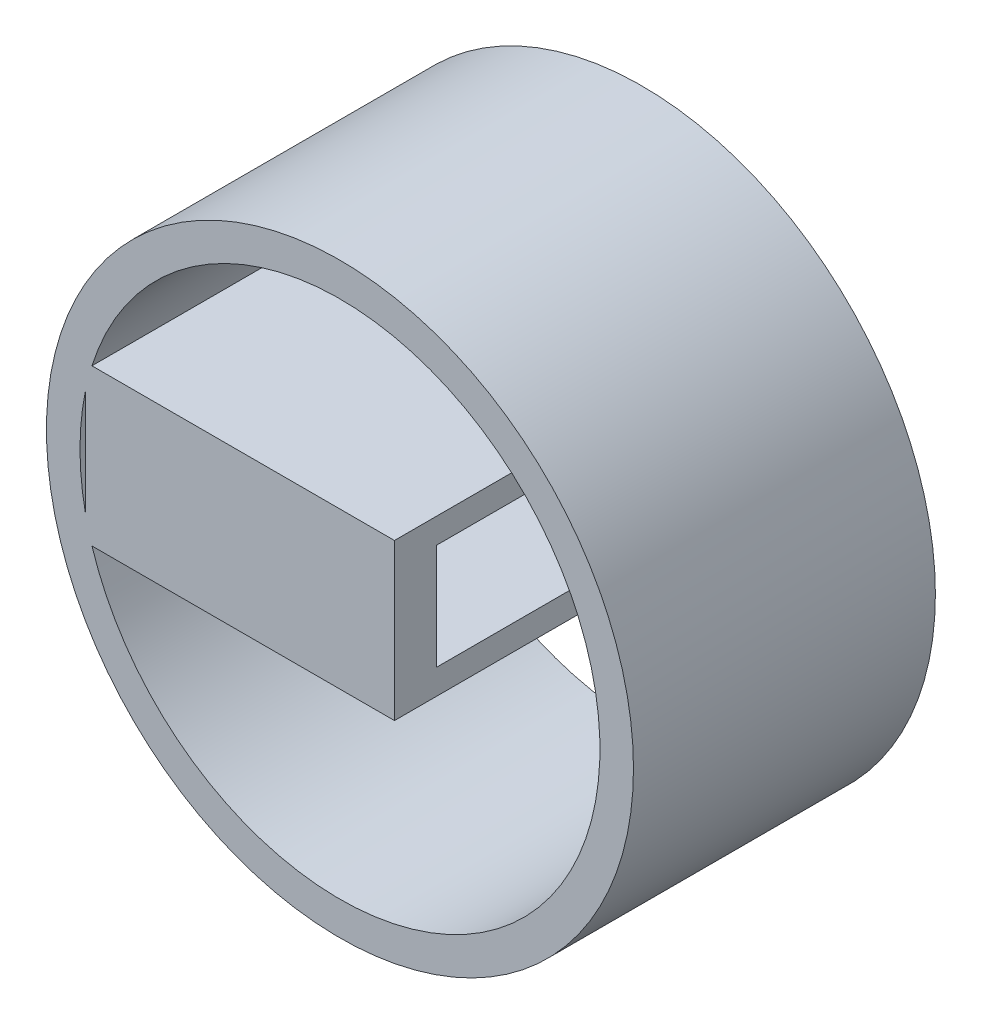
ISO-10303-21;
HEADER;
FILE_DESCRIPTION(('STEP AP214'),'2;1');
FILE_NAME('part.step','',(''),(''),'','','');
FILE_SCHEMA(('AUTOMOTIVE_DESIGN { 1 0 10303 214 1 1 1 1 }'));
ENDSEC;
DATA;
#1=APPLICATION_CONTEXT('core data for automotive mechanical design processes');
#2=APPLICATION_PROTOCOL_DEFINITION('international standard','automotive_design',2000,#1);
#3=PRODUCT_CONTEXT('',#1,'mechanical');
#4=PRODUCT('Part','Part','',(#3));
#5=PRODUCT_RELATED_PRODUCT_CATEGORY('part','',(#4));
#6=PRODUCT_DEFINITION_FORMATION('','',#4);
#7=PRODUCT_DEFINITION_CONTEXT('part definition',#1,'design');
#8=PRODUCT_DEFINITION('design','',#6,#7);
#9=PRODUCT_DEFINITION_SHAPE('','',#8);
#10=(LENGTH_UNIT() NAMED_UNIT(*) SI_UNIT(.MILLI.,.METRE.));
#11=(NAMED_UNIT(*) PLANE_ANGLE_UNIT() SI_UNIT($,.RADIAN.));
#12=(NAMED_UNIT(*) SI_UNIT($,.STERADIAN.) SOLID_ANGLE_UNIT());
#13=UNCERTAINTY_MEASURE_WITH_UNIT(LENGTH_MEASURE(1.E-05),#10,'distance_accuracy_value','');
#14=(GEOMETRIC_REPRESENTATION_CONTEXT(3) GLOBAL_UNCERTAINTY_ASSIGNED_CONTEXT((#13)) GLOBAL_UNIT_ASSIGNED_CONTEXT((#10,
#11,#12)) REPRESENTATION_CONTEXT('',''));
#15=CARTESIAN_POINT('',(0.,0.,0.));
#16=DIRECTION('',(0.,0.,1.));
#17=DIRECTION('',(1.,0.,0.));
#18=AXIS2_PLACEMENT_3D('',#15,#16,#17);
#19=CARTESIAN_POINT('',(0.,0.,36.));
#20=DIRECTION('',(0.,0.,-1.));
#21=DIRECTION('',(-1.,0.,0.));
#22=AXIS2_PLACEMENT_3D('',#19,#20,#21);
#23=CYLINDRICAL_SURFACE('',#22,31.);
#24=CARTESIAN_POINT('',(0.,0.,0.));
#25=DIRECTION('',(0.,0.,1.));
#26=DIRECTION('',(1.,0.,0.));
#27=AXIS2_PLACEMENT_3D('',#24,#25,#26);
#28=CIRCLE('',#27,31.);
#29=CARTESIAN_POINT('',(31.,0.,0.));
#30=VERTEX_POINT('',#29);
#31=EDGE_CURVE('E262',#30,#30,#28,.T.);
#32=ORIENTED_EDGE('',*,*,#31,.F.);
#33=EDGE_LOOP('',(#32));
#34=FACE_BOUND('',#33,.T.);
#35=CARTESIAN_POINT('',(0.,0.,0.999999999999994));
#36=DIRECTION('',(0.,0.,1.));
#37=DIRECTION('',(1.,0.,0.));
#38=AXIS2_PLACEMENT_3D('',#35,#36,#37);
#39=CIRCLE('',#38,31.);
#40=CARTESIAN_POINT('',(-30.3530888049305,6.3,0.999999999999994));
#41=VERTEX_POINT('',#40);
#42=CARTESIAN_POINT('',(-29.5721152439253,9.3,0.999999999999994));
#43=VERTEX_POINT('',#42);
#44=EDGE_CURVE('E165',#41,#43,#39,.F.);
#45=ORIENTED_EDGE('',*,*,#44,.F.);
#46=DIRECTION('',(0.,0.,1.));
#47=VECTOR('',#46,1.);
#48=CARTESIAN_POINT('',(-30.3530888049305,6.3,9.));
#49=LINE('',#48,#47);
#50=CARTESIAN_POINT('',(-30.3530888049305,6.3,16.));
#51=VERTEX_POINT('',#50);
#52=EDGE_CURVE('E259',#41,#51,#49,.T.);
#53=ORIENTED_EDGE('',*,*,#52,.T.);
#54=DIRECTION('',(0.,0.,1.));
#55=VECTOR('',#54,1.);
#56=CARTESIAN_POINT('',(-30.3530888049305,6.3,16.));
#57=LINE('',#56,#55);
#58=CARTESIAN_POINT('',(-30.3530888049305,6.3,36.));
#59=VERTEX_POINT('',#58);
#60=EDGE_CURVE('E227',#51,#59,#57,.T.);
#61=ORIENTED_EDGE('',*,*,#60,.T.);
#62=CARTESIAN_POINT('',(0.,0.,36.));
#63=DIRECTION('',(0.,0.,1.));
#64=DIRECTION('',(1.,0.,0.));
#65=AXIS2_PLACEMENT_3D('',#62,#63,#64);
#66=CIRCLE('',#65,31.);
#67=CARTESIAN_POINT('',(-30.3530888049305,-6.3,36.));
#68=VERTEX_POINT('',#67);
#69=EDGE_CURVE('E264',#59,#68,#66,.T.);
#70=ORIENTED_EDGE('',*,*,#69,.T.);
#71=DIRECTION('',(0.,0.,1.));
#72=VECTOR('',#71,1.);
#73=CARTESIAN_POINT('',(-30.3530888049305,-6.3,16.));
#74=LINE('',#73,#72);
#75=CARTESIAN_POINT('',(-30.3530888049305,-6.3,16.));
#76=VERTEX_POINT('',#75);
#77=EDGE_CURVE('E234',#76,#68,#74,.T.);
#78=ORIENTED_EDGE('',*,*,#77,.F.);
#79=DIRECTION('',(0.,0.,1.));
#80=VECTOR('',#79,1.);
#81=CARTESIAN_POINT('',(-30.3530888049305,-6.3,9.));
#82=LINE('',#81,#80);
#83=CARTESIAN_POINT('',(-30.3530888049305,-6.3,0.999999999999994));
#84=VERTEX_POINT('',#83);
#85=EDGE_CURVE('E245',#84,#76,#82,.T.);
#86=ORIENTED_EDGE('',*,*,#85,.F.);
#87=CARTESIAN_POINT('',(0.,0.,0.999999999999994));
#88=DIRECTION('',(0.,0.,1.));
#89=DIRECTION('',(1.,0.,0.));
#90=AXIS2_PLACEMENT_3D('',#87,#88,#89);
#91=CIRCLE('',#90,31.);
#92=CARTESIAN_POINT('',(-29.5721152439253,-9.3,0.999999999999994));
#93=VERTEX_POINT('',#92);
#94=EDGE_CURVE('E177',#93,#84,#91,.F.);
#95=ORIENTED_EDGE('',*,*,#94,.F.);
#96=DIRECTION('',(0.,0.,1.));
#97=VECTOR('',#96,1.);
#98=CARTESIAN_POINT('',(-29.5721152439253,-9.3,9.));
#99=LINE('',#98,#97);
#100=CARTESIAN_POINT('',(-29.5721152439253,-9.3,36.));
#101=VERTEX_POINT('',#100);
#102=EDGE_CURVE('E247',#93,#101,#99,.T.);
#103=ORIENTED_EDGE('',*,*,#102,.T.);
#104=CARTESIAN_POINT('',(-29.5721152439253,9.3,36.));
#105=VERTEX_POINT('',#104);
#106=EDGE_CURVE('E268',#101,#105,#66,.T.);
#107=ORIENTED_EDGE('',*,*,#106,.T.);
#108=DIRECTION('',(0.,0.,1.));
#109=VECTOR('',#108,1.);
#110=CARTESIAN_POINT('',(-29.5721152439253,9.3,9.));
#111=LINE('',#110,#109);
#112=EDGE_CURVE('E257',#43,#105,#111,.T.);
#113=ORIENTED_EDGE('',*,*,#112,.F.);
#114=EDGE_LOOP('',(#45,#53,#61,#70,#78,#86,#95,#103,#107,#113));
#115=FACE_BOUND('',#114,.T.);
#116=ADVANCED_FACE('F34',(#34,#115),#23,.F.);
#117=CARTESIAN_POINT('',(0.,0.,9.));
#118=DIRECTION('',(0.,0.,1.));
#119=DIRECTION('',(1.,0.,0.));
#120=AXIS2_PLACEMENT_3D('',#117,#118,#119);
#121=PLANE('',#120);
#122=DIRECTION('',(0.,-1.,0.));
#123=VECTOR('',#122,1.);
#124=CARTESIAN_POINT('',(0.,0.,9.));
#125=LINE('',#124,#123);
#126=CARTESIAN_POINT('',(0.,9.3,9.));
#127=VERTEX_POINT('',#126);
#128=CARTESIAN_POINT('',(0.,6.3,9.));
#129=VERTEX_POINT('',#128);
#130=EDGE_CURVE('E11',#127,#129,#125,.T.);
#131=ORIENTED_EDGE('',*,*,#130,.F.);
#132=DIRECTION('',(-1.,0.,0.));
#133=VECTOR('',#132,1.);
#134=CARTESIAN_POINT('',(0.,9.3,9.));
#135=LINE('',#134,#133);
#136=CARTESIAN_POINT('',(6.5,9.3,9.));
#137=VERTEX_POINT('',#136);
#138=EDGE_CURVE('E148',#137,#127,#135,.T.);
#139=ORIENTED_EDGE('',*,*,#138,.F.);
#140=DIRECTION('',(0.,1.,0.));
#141=VECTOR('',#140,1.);
#142=CARTESIAN_POINT('',(6.5,0.,9.));
#143=LINE('',#142,#141);
#144=CARTESIAN_POINT('',(6.5,6.3,9.));
#145=VERTEX_POINT('',#144);
#146=EDGE_CURVE('E206',#145,#137,#143,.T.);
#147=ORIENTED_EDGE('',*,*,#146,.F.);
#148=DIRECTION('',(-1.,0.,0.));
#149=VECTOR('',#148,1.);
#150=CARTESIAN_POINT('',(0.,6.3,9.));
#151=LINE('',#150,#149);
#152=EDGE_CURVE('E253',#145,#129,#151,.T.);
#153=ORIENTED_EDGE('',*,*,#152,.T.);
#154=EDGE_LOOP('',(#131,#139,#147,#153));
#155=FACE_BOUND('',#154,.T.);
#156=ADVANCED_FACE('F299',(#155),#121,.F.);
#157=CARTESIAN_POINT('',(0.,0.,9.));
#158=DIRECTION('',(0.,0.,1.));
#159=DIRECTION('',(1.,0.,0.));
#160=AXIS2_PLACEMENT_3D('',#157,#158,#159);
#161=PLANE('',#160);
#162=DIRECTION('',(0.,-1.,0.));
#163=VECTOR('',#162,1.);
#164=CARTESIAN_POINT('',(0.,0.,9.));
#165=LINE('',#164,#163);
#166=CARTESIAN_POINT('',(0.,-6.3,9.));
#167=VERTEX_POINT('',#166);
#168=CARTESIAN_POINT('',(0.,-9.3,9.));
#169=VERTEX_POINT('',#168);
#170=EDGE_CURVE('E42',#167,#169,#165,.T.);
#171=ORIENTED_EDGE('',*,*,#170,.F.);
#172=DIRECTION('',(-1.,0.,0.));
#173=VECTOR('',#172,1.);
#174=CARTESIAN_POINT('',(0.,-6.3,9.));
#175=LINE('',#174,#173);
#176=CARTESIAN_POINT('',(6.5,-6.3,9.));
#177=VERTEX_POINT('',#176);
#178=EDGE_CURVE('E242',#177,#167,#175,.T.);
#179=ORIENTED_EDGE('',*,*,#178,.F.);
#180=DIRECTION('',(0.,1.,0.));
#181=VECTOR('',#180,1.);
#182=CARTESIAN_POINT('',(6.5,0.,9.));
#183=LINE('',#182,#181);
#184=CARTESIAN_POINT('',(6.5,-9.3,9.));
#185=VERTEX_POINT('',#184);
#186=EDGE_CURVE('E194',#185,#177,#183,.T.);
#187=ORIENTED_EDGE('',*,*,#186,.F.);
#188=DIRECTION('',(-1.,0.,0.));
#189=VECTOR('',#188,1.);
#190=CARTESIAN_POINT('',(0.,-9.3,9.));
#191=LINE('',#190,#189);
#192=EDGE_CURVE('E239',#185,#169,#191,.T.);
#193=ORIENTED_EDGE('',*,*,#192,.T.);
#194=EDGE_LOOP('',(#171,#179,#187,#193));
#195=FACE_BOUND('',#194,.T.);
#196=ADVANCED_FACE('F285',(#195),#161,.F.);
#197=CARTESIAN_POINT('',(0.,6.3,9.));
#198=DIRECTION('',(0.,1.,0.));
#199=DIRECTION('',(0.,0.,1.));
#200=AXIS2_PLACEMENT_3D('',#197,#198,#199);
#201=PLANE('',#200);
#202=ORIENTED_EDGE('',*,*,#52,.F.);
#203=DIRECTION('',(-1.,0.,0.));
#204=VECTOR('',#203,1.);
#205=CARTESIAN_POINT('',(0.,6.3,0.999999999999994));
#206=LINE('',#205,#204);
#207=CARTESIAN_POINT('',(0.,6.3,0.999999999999994));
#208=VERTEX_POINT('',#207);
#209=EDGE_CURVE('E152',#208,#41,#206,.T.);
#210=ORIENTED_EDGE('',*,*,#209,.F.);
#211=DIRECTION('',(0.,0.,1.));
#212=VECTOR('',#211,1.);
#213=CARTESIAN_POINT('',(0.,6.3,0.999999999999994));
#214=LINE('',#213,#212);
#215=EDGE_CURVE('E151',#208,#129,#214,.T.);
#216=ORIENTED_EDGE('',*,*,#215,.T.);
#217=ORIENTED_EDGE('',*,*,#152,.F.);
#218=DIRECTION('',(0.,0.,-1.));
#219=VECTOR('',#218,1.);
#220=CARTESIAN_POINT('',(6.5,6.3,0.));
#221=LINE('',#220,#219);
#222=CARTESIAN_POINT('',(6.5,6.3,31.));
#223=VERTEX_POINT('',#222);
#224=EDGE_CURVE('E203',#223,#145,#221,.T.);
#225=ORIENTED_EDGE('',*,*,#224,.F.);
#226=DIRECTION('',(-1.,0.,0.));
#227=VECTOR('',#226,1.);
#228=CARTESIAN_POINT('',(-17.,6.3,31.));
#229=LINE('',#228,#227);
#230=CARTESIAN_POINT('',(-17.,6.3,31.));
#231=VERTEX_POINT('',#230);
#232=EDGE_CURVE('E49',#223,#231,#229,.T.);
#233=ORIENTED_EDGE('',*,*,#232,.T.);
#234=DIRECTION('',(0.,0.,1.));
#235=VECTOR('',#234,1.);
#236=CARTESIAN_POINT('',(-17.,6.3,16.));
#237=LINE('',#236,#235);
#238=CARTESIAN_POINT('',(-17.,6.3,16.));
#239=VERTEX_POINT('',#238);
#240=EDGE_CURVE('E229',#239,#231,#237,.T.);
#241=ORIENTED_EDGE('',*,*,#240,.F.);
#242=DIRECTION('',(1.,0.,0.));
#243=VECTOR('',#242,1.);
#244=CARTESIAN_POINT('',(0.,6.3,16.));
#245=LINE('',#244,#243);
#246=EDGE_CURVE('E217',#51,#239,#245,.T.);
#247=ORIENTED_EDGE('',*,*,#246,.F.);
#248=EDGE_LOOP('',(#202,#210,#216,#217,#225,#233,#241,#247));
#249=FACE_BOUND('',#248,.T.);
#250=ADVANCED_FACE('F297',(#249),#201,.F.);
#251=CARTESIAN_POINT('',(0.,-6.3,9.));
#252=DIRECTION('',(0.,1.,0.));
#253=DIRECTION('',(0.,0.,1.));
#254=AXIS2_PLACEMENT_3D('',#251,#252,#253);
#255=PLANE('',#254);
#256=DIRECTION('',(1.,0.,0.));
#257=VECTOR('',#256,1.);
#258=CARTESIAN_POINT('',(-17.,-6.3,31.));
#259=LINE('',#258,#257);
#260=CARTESIAN_POINT('',(-17.,-6.3,31.));
#261=VERTEX_POINT('',#260);
#262=CARTESIAN_POINT('',(6.5,-6.3,31.));
#263=VERTEX_POINT('',#262);
#264=EDGE_CURVE('E213',#261,#263,#259,.T.);
#265=ORIENTED_EDGE('',*,*,#264,.T.);
#266=DIRECTION('',(0.,0.,1.));
#267=VECTOR('',#266,1.);
#268=CARTESIAN_POINT('',(6.5,-6.3,0.));
#269=LINE('',#268,#267);
#270=EDGE_CURVE('E197',#177,#263,#269,.T.);
#271=ORIENTED_EDGE('',*,*,#270,.F.);
#272=ORIENTED_EDGE('',*,*,#178,.T.);
#273=DIRECTION('',(0.,0.,1.));
#274=VECTOR('',#273,1.);
#275=CARTESIAN_POINT('',(0.,-6.3,0.999999999999994));
#276=LINE('',#275,#274);
#277=CARTESIAN_POINT('',(0.,-6.3,0.999999999999994));
#278=VERTEX_POINT('',#277);
#279=EDGE_CURVE('E183',#278,#167,#276,.T.);
#280=ORIENTED_EDGE('',*,*,#279,.F.);
#281=DIRECTION('',(-1.,0.,0.));
#282=VECTOR('',#281,1.);
#283=CARTESIAN_POINT('',(0.,-6.3,0.999999999999994));
#284=LINE('',#283,#282);
#285=EDGE_CURVE('E174',#278,#84,#284,.T.);
#286=ORIENTED_EDGE('',*,*,#285,.T.);
#287=ORIENTED_EDGE('',*,*,#85,.T.);
#288=DIRECTION('',(-1.,0.,0.));
#289=VECTOR('',#288,1.);
#290=CARTESIAN_POINT('',(0.,-6.3,16.));
#291=LINE('',#290,#289);
#292=CARTESIAN_POINT('',(-17.,-6.3,16.));
#293=VERTEX_POINT('',#292);
#294=EDGE_CURVE('E223',#293,#76,#291,.T.);
#295=ORIENTED_EDGE('',*,*,#294,.F.);
#296=DIRECTION('',(0.,0.,1.));
#297=VECTOR('',#296,1.);
#298=CARTESIAN_POINT('',(-17.,-6.3,16.));
#299=LINE('',#298,#297);
#300=EDGE_CURVE('E232',#293,#261,#299,.T.);
#301=ORIENTED_EDGE('',*,*,#300,.T.);
#302=EDGE_LOOP('',(#265,#271,#272,#280,#286,#287,#295,#301));
#303=FACE_BOUND('',#302,.T.);
#304=ADVANCED_FACE('F291',(#303),#255,.T.);
#305=CARTESIAN_POINT('',(-17.,0.,16.));
#306=DIRECTION('',(-1.,0.,0.));
#307=DIRECTION('',(0.,0.,1.));
#308=AXIS2_PLACEMENT_3D('',#305,#306,#307);
#309=PLANE('',#308);
#310=DIRECTION('',(0.,-1.,0.));
#311=VECTOR('',#310,1.);
#312=CARTESIAN_POINT('',(-17.,6.3,31.));
#313=LINE('',#312,#311);
#314=EDGE_CURVE('E56',#231,#261,#313,.T.);
#315=ORIENTED_EDGE('',*,*,#314,.T.);
#316=ORIENTED_EDGE('',*,*,#300,.F.);
#317=DIRECTION('',(0.,-1.,0.));
#318=VECTOR('',#317,1.);
#319=CARTESIAN_POINT('',(-17.,0.,16.));
#320=LINE('',#319,#318);
#321=EDGE_CURVE('E225',#239,#293,#320,.T.);
#322=ORIENTED_EDGE('',*,*,#321,.F.);
#323=ORIENTED_EDGE('',*,*,#240,.T.);
#324=EDGE_LOOP('',(#315,#316,#322,#323));
#325=FACE_BOUND('',#324,.T.);
#326=ADVANCED_FACE('F320',(#325),#309,.F.);
#327=CARTESIAN_POINT('',(0.,0.,36.));
#328=DIRECTION('',(0.,0.,1.));
#329=DIRECTION('',(1.,0.,0.));
#330=AXIS2_PLACEMENT_3D('',#327,#328,#329);
#331=PLANE('',#330);
#332=ORIENTED_EDGE('',*,*,#69,.F.);
#333=DIRECTION('',(0.,-1.,0.));
#334=VECTOR('',#333,1.);
#335=CARTESIAN_POINT('',(-30.3530888049305,0.,36.));
#336=LINE('',#335,#334);
#337=EDGE_CURVE('E216',#59,#68,#336,.T.);
#338=ORIENTED_EDGE('',*,*,#337,.T.);
#339=EDGE_LOOP('',(#332,#338));
#340=FACE_BOUND('',#339,.T.);
#341=DIRECTION('',(-1.,0.,0.));
#342=VECTOR('',#341,1.);
#343=CARTESIAN_POINT('',(0.,9.3,36.));
#344=LINE('',#343,#342);
#345=CARTESIAN_POINT('',(6.5,9.3,36.));
#346=VERTEX_POINT('',#345);
#347=EDGE_CURVE('E250',#346,#105,#344,.T.);
#348=ORIENTED_EDGE('',*,*,#347,.T.);
#349=ORIENTED_EDGE('',*,*,#106,.F.);
#350=DIRECTION('',(-1.,0.,0.));
#351=VECTOR('',#350,1.);
#352=CARTESIAN_POINT('',(0.,-9.3,36.));
#353=LINE('',#352,#351);
#354=CARTESIAN_POINT('',(6.5,-9.3,36.));
#355=VERTEX_POINT('',#354);
#356=EDGE_CURVE('E231',#355,#101,#353,.T.);
#357=ORIENTED_EDGE('',*,*,#356,.F.);
#358=DIRECTION('',(0.,-1.,0.));
#359=VECTOR('',#358,1.);
#360=CARTESIAN_POINT('',(6.5,0.,36.));
#361=LINE('',#360,#359);
#362=EDGE_CURVE('E187',#346,#355,#361,.T.);
#363=ORIENTED_EDGE('',*,*,#362,.F.);
#364=EDGE_LOOP('',(#348,#349,#357,#363));
#365=FACE_BOUND('',#364,.T.);
#366=CARTESIAN_POINT('',(0.,0.,36.));
#367=DIRECTION('',(0.,0.,1.));
#368=DIRECTION('',(1.,0.,0.));
#369=AXIS2_PLACEMENT_3D('',#366,#367,#368);
#370=CIRCLE('',#369,35.);
#371=CARTESIAN_POINT('',(35.,0.,36.));
#372=VERTEX_POINT('',#371);
#373=EDGE_CURVE('E271',#372,#372,#370,.T.);
#374=ORIENTED_EDGE('',*,*,#373,.T.);
#375=EDGE_LOOP('',(#374));
#376=FACE_BOUND('',#375,.T.);
#377=ADVANCED_FACE('F304',(#340,#365,#376),#331,.T.);
#378=CARTESIAN_POINT('',(0.,0.,0.));
#379=DIRECTION('',(0.,0.,1.));
#380=DIRECTION('',(1.,0.,0.));
#381=AXIS2_PLACEMENT_3D('',#378,#379,#380);
#382=PLANE('',#381);
#383=CARTESIAN_POINT('',(0.,0.,0.));
#384=DIRECTION('',(0.,0.,1.));
#385=DIRECTION('',(1.,0.,0.));
#386=AXIS2_PLACEMENT_3D('',#383,#384,#385);
#387=CIRCLE('',#386,35.);
#388=CARTESIAN_POINT('',(35.,0.,0.));
#389=VERTEX_POINT('',#388);
#390=EDGE_CURVE('E267',#389,#389,#387,.T.);
#391=ORIENTED_EDGE('',*,*,#390,.F.);
#392=EDGE_LOOP('',(#391));
#393=FACE_BOUND('',#392,.T.);
#394=ORIENTED_EDGE('',*,*,#31,.T.);
#395=EDGE_LOOP('',(#394));
#396=FACE_BOUND('',#395,.T.);
#397=ADVANCED_FACE('F327',(#393,#396),#382,.F.);
#398=CARTESIAN_POINT('',(0.,0.,36.));
#399=DIRECTION('',(0.,0.,-1.));
#400=DIRECTION('',(-1.,0.,0.));
#401=AXIS2_PLACEMENT_3D('',#398,#399,#400);
#402=CYLINDRICAL_SURFACE('',#401,35.);
#403=ORIENTED_EDGE('',*,*,#373,.F.);
#404=EDGE_LOOP('',(#403));
#405=FACE_BOUND('',#404,.T.);
#406=ORIENTED_EDGE('',*,*,#390,.T.);
#407=EDGE_LOOP('',(#406));
#408=FACE_BOUND('',#407,.T.);
#409=ADVANCED_FACE('F36',(#405,#408),#402,.T.);
#410=CARTESIAN_POINT('',(0.,9.3,9.));
#411=DIRECTION('',(0.,1.,0.));
#412=DIRECTION('',(0.,0.,1.));
#413=AXIS2_PLACEMENT_3D('',#410,#411,#412);
#414=PLANE('',#413);
#415=ORIENTED_EDGE('',*,*,#112,.T.);
#416=ORIENTED_EDGE('',*,*,#347,.F.);
#417=DIRECTION('',(0.,0.,1.));
#418=VECTOR('',#417,1.);
#419=CARTESIAN_POINT('',(6.5,9.3,0.));
#420=LINE('',#419,#418);
#421=EDGE_CURVE('E209',#137,#346,#420,.T.);
#422=ORIENTED_EDGE('',*,*,#421,.F.);
#423=ORIENTED_EDGE('',*,*,#138,.T.);
#424=DIRECTION('',(0.,0.,1.));
#425=VECTOR('',#424,1.);
#426=CARTESIAN_POINT('',(0.,9.3,0.999999999999994));
#427=LINE('',#426,#425);
#428=CARTESIAN_POINT('',(0.,9.3,0.999999999999994));
#429=VERTEX_POINT('',#428);
#430=EDGE_CURVE('E141',#429,#127,#427,.T.);
#431=ORIENTED_EDGE('',*,*,#430,.F.);
#432=DIRECTION('',(-1.,0.,0.));
#433=VECTOR('',#432,1.);
#434=CARTESIAN_POINT('',(0.,9.3,0.999999999999994));
#435=LINE('',#434,#433);
#436=EDGE_CURVE('E146',#429,#43,#435,.T.);
#437=ORIENTED_EDGE('',*,*,#436,.T.);
#438=EDGE_LOOP('',(#415,#416,#422,#423,#431,#437));
#439=FACE_BOUND('',#438,.T.);
#440=ADVANCED_FACE('F144',(#439),#414,.T.);
#441=CARTESIAN_POINT('',(0.,-9.3,9.));
#442=DIRECTION('',(0.,1.,0.));
#443=DIRECTION('',(0.,0.,1.));
#444=AXIS2_PLACEMENT_3D('',#441,#442,#443);
#445=PLANE('',#444);
#446=ORIENTED_EDGE('',*,*,#102,.F.);
#447=DIRECTION('',(-1.,0.,0.));
#448=VECTOR('',#447,1.);
#449=CARTESIAN_POINT('',(0.,-9.3,0.999999999999994));
#450=LINE('',#449,#448);
#451=CARTESIAN_POINT('',(0.,-9.3,0.999999999999994));
#452=VERTEX_POINT('',#451);
#453=EDGE_CURVE('E180',#452,#93,#450,.T.);
#454=ORIENTED_EDGE('',*,*,#453,.F.);
#455=DIRECTION('',(0.,0.,1.));
#456=VECTOR('',#455,1.);
#457=CARTESIAN_POINT('',(0.,-9.3,0.999999999999994));
#458=LINE('',#457,#456);
#459=EDGE_CURVE('E184',#452,#169,#458,.T.);
#460=ORIENTED_EDGE('',*,*,#459,.T.);
#461=ORIENTED_EDGE('',*,*,#192,.F.);
#462=DIRECTION('',(0.,0.,-1.));
#463=VECTOR('',#462,1.);
#464=CARTESIAN_POINT('',(6.5,-9.3,0.));
#465=LINE('',#464,#463);
#466=EDGE_CURVE('E191',#355,#185,#465,.T.);
#467=ORIENTED_EDGE('',*,*,#466,.F.);
#468=ORIENTED_EDGE('',*,*,#356,.T.);
#469=EDGE_LOOP('',(#446,#454,#460,#461,#467,#468));
#470=FACE_BOUND('',#469,.T.);
#471=ADVANCED_FACE('F282',(#470),#445,.F.);
#472=CARTESIAN_POINT('',(-30.3530888049305,0.,16.));
#473=DIRECTION('',(-1.,0.,0.));
#474=DIRECTION('',(0.,0.,1.));
#475=AXIS2_PLACEMENT_3D('',#472,#473,#474);
#476=PLANE('',#475);
#477=ORIENTED_EDGE('',*,*,#337,.F.);
#478=ORIENTED_EDGE('',*,*,#60,.F.);
#479=DIRECTION('',(0.,-1.,0.));
#480=VECTOR('',#479,1.);
#481=CARTESIAN_POINT('',(-30.3530888049305,0.,16.));
#482=LINE('',#481,#480);
#483=EDGE_CURVE('E220',#51,#76,#482,.T.);
#484=ORIENTED_EDGE('',*,*,#483,.T.);
#485=ORIENTED_EDGE('',*,*,#77,.T.);
#486=EDGE_LOOP('',(#477,#478,#484,#485));
#487=FACE_BOUND('',#486,.T.);
#488=ADVANCED_FACE('F314',(#487),#476,.T.);
#489=CARTESIAN_POINT('',(0.,0.,16.));
#490=DIRECTION('',(0.,0.,1.));
#491=DIRECTION('',(1.,0.,0.));
#492=AXIS2_PLACEMENT_3D('',#489,#490,#491);
#493=PLANE('',#492);
#494=ORIENTED_EDGE('',*,*,#246,.T.);
#495=ORIENTED_EDGE('',*,*,#321,.T.);
#496=ORIENTED_EDGE('',*,*,#294,.T.);
#497=ORIENTED_EDGE('',*,*,#483,.F.);
#498=EDGE_LOOP('',(#494,#495,#496,#497));
#499=FACE_BOUND('',#498,.T.);
#500=ADVANCED_FACE('F318',(#499),#493,.F.);
#501=CARTESIAN_POINT('',(0.,0.,31.));
#502=DIRECTION('',(0.,0.,1.));
#503=DIRECTION('',(1.,0.,0.));
#504=AXIS2_PLACEMENT_3D('',#501,#502,#503);
#505=PLANE('',#504);
#506=ORIENTED_EDGE('',*,*,#314,.F.);
#507=ORIENTED_EDGE('',*,*,#232,.F.);
#508=DIRECTION('',(0.,1.,0.));
#509=VECTOR('',#508,1.);
#510=CARTESIAN_POINT('',(6.5,0.,31.));
#511=LINE('',#510,#509);
#512=EDGE_CURVE('E200',#263,#223,#511,.T.);
#513=ORIENTED_EDGE('',*,*,#512,.F.);
#514=ORIENTED_EDGE('',*,*,#264,.F.);
#515=EDGE_LOOP('',(#506,#507,#513,#514));
#516=FACE_BOUND('',#515,.T.);
#517=ADVANCED_FACE('F295',(#516),#505,.F.);
#518=CARTESIAN_POINT('',(6.5,0.,0.));
#519=DIRECTION('',(1.,0.,0.));
#520=DIRECTION('',(0.,0.,-1.));
#521=AXIS2_PLACEMENT_3D('',#518,#519,#520);
#522=PLANE('',#521);
#523=ORIENTED_EDGE('',*,*,#362,.T.);
#524=ORIENTED_EDGE('',*,*,#466,.T.);
#525=ORIENTED_EDGE('',*,*,#186,.T.);
#526=ORIENTED_EDGE('',*,*,#270,.T.);
#527=ORIENTED_EDGE('',*,*,#512,.T.);
#528=ORIENTED_EDGE('',*,*,#224,.T.);
#529=ORIENTED_EDGE('',*,*,#146,.T.);
#530=ORIENTED_EDGE('',*,*,#421,.T.);
#531=EDGE_LOOP('',(#523,#524,#525,#526,#527,#528,#529,#530));
#532=FACE_BOUND('',#531,.T.);
#533=ADVANCED_FACE('F288',(#532),#522,.T.);
#534=CARTESIAN_POINT('',(0.,0.,0.999999999999994));
#535=DIRECTION('',(-1.,0.,0.));
#536=DIRECTION('',(0.,0.,1.));
#537=AXIS2_PLACEMENT_3D('',#534,#535,#536);
#538=PLANE('',#537);
#539=ORIENTED_EDGE('',*,*,#279,.T.);
#540=ORIENTED_EDGE('',*,*,#170,.T.);
#541=ORIENTED_EDGE('',*,*,#459,.F.);
#542=DIRECTION('',(0.,-1.,0.));
#543=VECTOR('',#542,1.);
#544=CARTESIAN_POINT('',(0.,0.,0.999999999999994));
#545=LINE('',#544,#543);
#546=EDGE_CURVE('E170',#278,#452,#545,.T.);
#547=ORIENTED_EDGE('',*,*,#546,.F.);
#548=EDGE_LOOP('',(#539,#540,#541,#547));
#549=FACE_BOUND('',#548,.T.);
#550=ADVANCED_FACE('F278',(#549),#538,.F.);
#551=CARTESIAN_POINT('',(0.,0.,0.999999999999994));
#552=DIRECTION('',(0.,0.,1.));
#553=DIRECTION('',(1.,0.,0.));
#554=AXIS2_PLACEMENT_3D('',#551,#552,#553);
#555=PLANE('',#554);
#556=ORIENTED_EDGE('',*,*,#546,.T.);
#557=ORIENTED_EDGE('',*,*,#453,.T.);
#558=ORIENTED_EDGE('',*,*,#94,.T.);
#559=ORIENTED_EDGE('',*,*,#285,.F.);
#560=EDGE_LOOP('',(#556,#557,#558,#559));
#561=FACE_BOUND('',#560,.T.);
#562=ADVANCED_FACE('F309',(#561),#555,.F.);
#563=CARTESIAN_POINT('',(0.,0.,0.999999999999994));
#564=DIRECTION('',(-1.,0.,0.));
#565=DIRECTION('',(0.,0.,1.));
#566=AXIS2_PLACEMENT_3D('',#563,#564,#565);
#567=PLANE('',#566);
#568=ORIENTED_EDGE('',*,*,#430,.T.);
#569=ORIENTED_EDGE('',*,*,#130,.T.);
#570=ORIENTED_EDGE('',*,*,#215,.F.);
#571=DIRECTION('',(0.,-1.,0.));
#572=VECTOR('',#571,1.);
#573=CARTESIAN_POINT('',(0.,0.,0.999999999999994));
#574=LINE('',#573,#572);
#575=EDGE_CURVE('E156',#429,#208,#574,.T.);
#576=ORIENTED_EDGE('',*,*,#575,.F.);
#577=EDGE_LOOP('',(#568,#569,#570,#576));
#578=FACE_BOUND('',#577,.T.);
#579=ADVANCED_FACE('F157',(#578),#567,.F.);
#580=CARTESIAN_POINT('',(0.,0.,0.999999999999994));
#581=DIRECTION('',(0.,0.,1.));
#582=DIRECTION('',(1.,0.,0.));
#583=AXIS2_PLACEMENT_3D('',#580,#581,#582);
#584=PLANE('',#583);
#585=ORIENTED_EDGE('',*,*,#575,.T.);
#586=ORIENTED_EDGE('',*,*,#209,.T.);
#587=ORIENTED_EDGE('',*,*,#44,.T.);
#588=ORIENTED_EDGE('',*,*,#436,.F.);
#589=EDGE_LOOP('',(#585,#586,#587,#588));
#590=FACE_BOUND('',#589,.T.);
#591=ADVANCED_FACE('F163',(#590),#584,.F.);
#592=CLOSED_SHELL('',(#116,#156,#196,#250,#304,#326,#377,#397,#409,#440,#471,#488,#500,#517,
#533,#550,#562,#579,#591));
#593=MANIFOLD_SOLID_BREP('B2',#592);
#594=ADVANCED_BREP_SHAPE_REPRESENTATION('',(#18,#593),#14);
#595=SHAPE_DEFINITION_REPRESENTATION(#9,#594);
ENDSEC;
END-ISO-10303-21;
